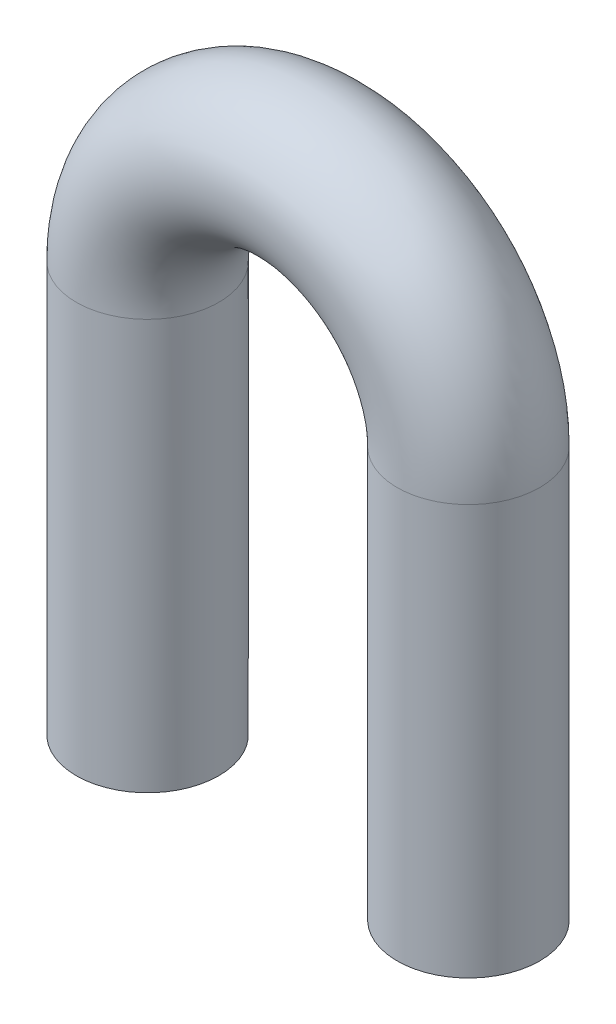
ISO-10303-21;
HEADER;
FILE_DESCRIPTION(('STEP AP214'),'2;1');
FILE_NAME('part.step','',(''),(''),'','','');
FILE_SCHEMA(('AUTOMOTIVE_DESIGN { 1 0 10303 214 1 1 1 1 }'));
ENDSEC;
DATA;
#1=APPLICATION_CONTEXT('core data for automotive mechanical design processes');
#2=APPLICATION_PROTOCOL_DEFINITION('international standard','automotive_design',2000,#1);
#3=PRODUCT_CONTEXT('',#1,'mechanical');
#4=PRODUCT('Part','Part','',(#3));
#5=PRODUCT_RELATED_PRODUCT_CATEGORY('part','',(#4));
#6=PRODUCT_DEFINITION_FORMATION('','',#4);
#7=PRODUCT_DEFINITION_CONTEXT('part definition',#1,'design');
#8=PRODUCT_DEFINITION('design','',#6,#7);
#9=PRODUCT_DEFINITION_SHAPE('','',#8);
#10=(LENGTH_UNIT() NAMED_UNIT(*) SI_UNIT(.MILLI.,.METRE.));
#11=(NAMED_UNIT(*) PLANE_ANGLE_UNIT() SI_UNIT($,.RADIAN.));
#12=(NAMED_UNIT(*) SI_UNIT($,.STERADIAN.) SOLID_ANGLE_UNIT());
#13=UNCERTAINTY_MEASURE_WITH_UNIT(LENGTH_MEASURE(1.E-05),#10,'distance_accuracy_value','');
#14=(GEOMETRIC_REPRESENTATION_CONTEXT(3) GLOBAL_UNCERTAINTY_ASSIGNED_CONTEXT((#13)) GLOBAL_UNIT_ASSIGNED_CONTEXT((#10,
#11,#12)) REPRESENTATION_CONTEXT('',''));
#15=CARTESIAN_POINT('',(0.,0.,0.));
#16=DIRECTION('',(0.,0.,1.));
#17=DIRECTION('',(1.,0.,0.));
#18=AXIS2_PLACEMENT_3D('',#15,#16,#17);
#19=CARTESIAN_POINT('',(0.,0.,0.));
#20=DIRECTION('',(0.,0.,-1.));
#21=DIRECTION('',(-1.,0.,0.));
#22=AXIS2_PLACEMENT_3D('',#19,#20,#21);
#23=TOROIDAL_SURFACE('',#22,4.5,2.);
#24=CARTESIAN_POINT('',(-4.5,0.,0.));
#25=DIRECTION('',(0.,-1.,0.));
#26=DIRECTION('',(0.,0.,1.));
#27=AXIS2_PLACEMENT_3D('',#24,#25,#26);
#28=CIRCLE('',#27,2.);
#29=CARTESIAN_POINT('',(-6.5,0.,0.));
#30=VERTEX_POINT('',#29);
#31=EDGE_CURVE('E10',#30,#30,#28,.T.);
#32=CARTESIAN_POINT('',(4.5,0.,0.));
#33=DIRECTION('',(0.,1.,0.));
#34=DIRECTION('',(0.,0.,1.));
#35=AXIS2_PLACEMENT_3D('',#32,#33,#34);
#36=CIRCLE('',#35,2.);
#37=CARTESIAN_POINT('',(6.5,0.,0.));
#38=VERTEX_POINT('',#37);
#39=EDGE_CURVE('E48',#38,#38,#36,.T.);
#40=CARTESIAN_POINT('',(0.,0.,0.));
#41=DIRECTION('',(0.,0.,-1.));
#42=DIRECTION('',(-1.,0.,0.));
#43=AXIS2_PLACEMENT_3D('',#40,#41,#42);
#44=CIRCLE('',#43,6.5);
#45=EDGE_CURVE('',#30,#38,#44,.T.);
#46=ORIENTED_EDGE('',*,*,#31,.F.);
#47=ORIENTED_EDGE('',*,*,#39,.T.);
#48=ORIENTED_EDGE('',*,*,#45,.T.);
#49=ORIENTED_EDGE('',*,*,#45,.F.);
#50=EDGE_LOOP('',(#46,#48,#47,#49));
#51=FACE_BOUND('',#50,.T.);
#52=ADVANCED_FACE('F41',(#51),#23,.T.);
#53=CARTESIAN_POINT('',(4.50000000000008,-11.5,0.));
#54=DIRECTION('',(0.,1.,0.));
#55=DIRECTION('',(-1.,0.,0.));
#56=AXIS2_PLACEMENT_3D('',#53,#54,#55);
#57=CYLINDRICAL_SURFACE('',#56,2.);
#58=CARTESIAN_POINT('',(4.50000000000008,-11.5,0.));
#59=DIRECTION('',(0.,-1.,0.));
#60=DIRECTION('',(1.,0.,0.));
#61=AXIS2_PLACEMENT_3D('',#58,#59,#60);
#62=CIRCLE('',#61,2.);
#63=CARTESIAN_POINT('',(6.50000000000008,-11.5,0.));
#64=VERTEX_POINT('',#63);
#65=EDGE_CURVE('E53',#64,#64,#62,.T.);
#66=ORIENTED_EDGE('',*,*,#65,.F.);
#67=EDGE_LOOP('',(#66));
#68=FACE_BOUND('',#67,.T.);
#69=ORIENTED_EDGE('',*,*,#39,.F.);
#70=EDGE_LOOP('',(#69));
#71=FACE_BOUND('',#70,.T.);
#72=ADVANCED_FACE('F76',(#68,#71),#57,.T.);
#73=CARTESIAN_POINT('',(4.50000000000008,-11.5,0.));
#74=DIRECTION('',(0.,-1.,0.));
#75=DIRECTION('',(1.,0.,0.));
#76=AXIS2_PLACEMENT_3D('',#73,#74,#75);
#77=PLANE('',#76);
#78=ORIENTED_EDGE('',*,*,#65,.T.);
#79=EDGE_LOOP('',(#78));
#80=FACE_BOUND('',#79,.T.);
#81=ADVANCED_FACE('F69',(#80),#77,.T.);
#82=CARTESIAN_POINT('',(-4.49999999999992,-11.5,0.));
#83=DIRECTION('',(0.,1.,0.));
#84=DIRECTION('',(-1.,0.,0.));
#85=AXIS2_PLACEMENT_3D('',#82,#83,#84);
#86=CYLINDRICAL_SURFACE('',#85,2.);
#87=CARTESIAN_POINT('',(-4.49999999999992,-11.5,0.));
#88=DIRECTION('',(0.,-1.,0.));
#89=DIRECTION('',(1.,0.,0.));
#90=AXIS2_PLACEMENT_3D('',#87,#88,#89);
#91=CIRCLE('',#90,2.);
#92=CARTESIAN_POINT('',(-2.49999999999992,-11.5,0.));
#93=VERTEX_POINT('',#92);
#94=EDGE_CURVE('E58',#93,#93,#91,.T.);
#95=ORIENTED_EDGE('',*,*,#94,.F.);
#96=EDGE_LOOP('',(#95));
#97=FACE_BOUND('',#96,.T.);
#98=ORIENTED_EDGE('',*,*,#31,.T.);
#99=EDGE_LOOP('',(#98));
#100=FACE_BOUND('',#99,.T.);
#101=ADVANCED_FACE('F67',(#97,#100),#86,.T.);
#102=CARTESIAN_POINT('',(-4.49999999999992,-11.5,0.));
#103=DIRECTION('',(0.,-1.,0.));
#104=DIRECTION('',(1.,0.,0.));
#105=AXIS2_PLACEMENT_3D('',#102,#103,#104);
#106=PLANE('',#105);
#107=ORIENTED_EDGE('',*,*,#94,.T.);
#108=EDGE_LOOP('',(#107));
#109=FACE_BOUND('',#108,.T.);
#110=ADVANCED_FACE('F65',(#109),#106,.T.);
#111=CLOSED_SHELL('',(#52,#72,#81,#101,#110));
#112=MANIFOLD_SOLID_BREP('B2',#111);
#113=ADVANCED_BREP_SHAPE_REPRESENTATION('',(#18,#112),#14);
#114=SHAPE_DEFINITION_REPRESENTATION(#9,#113);
ENDSEC;
END-ISO-10303-21;
